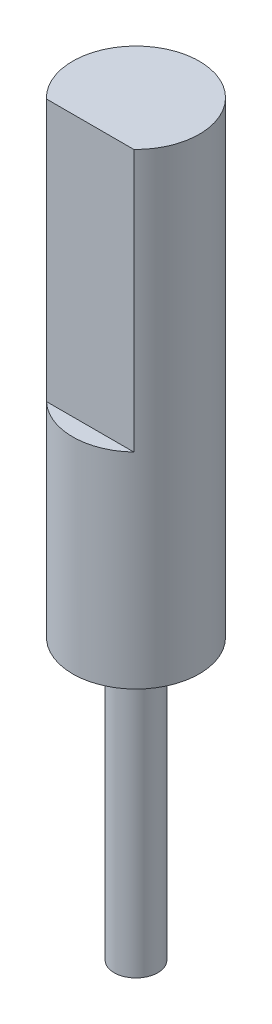
ISO-10303-21;
HEADER;
FILE_DESCRIPTION(('STEP AP214'),'2;1');
FILE_NAME('part.step','',(''),(''),'','','');
FILE_SCHEMA(('AUTOMOTIVE_DESIGN { 1 0 10303 214 1 1 1 1 }'));
ENDSEC;
DATA;
#1=APPLICATION_CONTEXT('core data for automotive mechanical design processes');
#2=APPLICATION_PROTOCOL_DEFINITION('international standard','automotive_design',2000,#1);
#3=PRODUCT_CONTEXT('',#1,'mechanical');
#4=PRODUCT('Part','Part','',(#3));
#5=PRODUCT_RELATED_PRODUCT_CATEGORY('part','',(#4));
#6=PRODUCT_DEFINITION_FORMATION('','',#4);
#7=PRODUCT_DEFINITION_CONTEXT('part definition',#1,'design');
#8=PRODUCT_DEFINITION('design','',#6,#7);
#9=PRODUCT_DEFINITION_SHAPE('','',#8);
#10=(LENGTH_UNIT() NAMED_UNIT(*) SI_UNIT(.MILLI.,.METRE.));
#11=(NAMED_UNIT(*) PLANE_ANGLE_UNIT() SI_UNIT($,.RADIAN.));
#12=(NAMED_UNIT(*) SI_UNIT($,.STERADIAN.) SOLID_ANGLE_UNIT());
#13=UNCERTAINTY_MEASURE_WITH_UNIT(LENGTH_MEASURE(1.E-05),#10,'distance_accuracy_value','');
#14=(GEOMETRIC_REPRESENTATION_CONTEXT(3) GLOBAL_UNCERTAINTY_ASSIGNED_CONTEXT((#13)) GLOBAL_UNIT_ASSIGNED_CONTEXT((#10,
#11,#12)) REPRESENTATION_CONTEXT('',''));
#15=CARTESIAN_POINT('',(0.,0.,0.));
#16=DIRECTION('',(0.,0.,1.));
#17=DIRECTION('',(1.,0.,0.));
#18=AXIS2_PLACEMENT_3D('',#15,#16,#17);
#19=CARTESIAN_POINT('',(0.,10.7,0.));
#20=DIRECTION('',(0.,-1.,0.));
#21=DIRECTION('',(0.,0.,-1.));
#22=AXIS2_PLACEMENT_3D('',#19,#20,#21);
#23=CYLINDRICAL_SURFACE('',#22,1.45);
#24=CARTESIAN_POINT('',(0.,10.7,0.));
#25=DIRECTION('',(0.,1.,0.));
#26=DIRECTION('',(0.,0.,1.));
#27=AXIS2_PLACEMENT_3D('',#24,#25,#26);
#28=CIRCLE('',#27,1.45);
#29=CARTESIAN_POINT('',(0.999999999999999,10.7,1.05));
#30=VERTEX_POINT('',#29);
#31=CARTESIAN_POINT('',(-0.999999999999999,10.7,1.05));
#32=VERTEX_POINT('',#31);
#33=EDGE_CURVE('E62',#30,#32,#28,.T.);
#34=ORIENTED_EDGE('',*,*,#33,.F.);
#35=DIRECTION('',(0.,1.,0.));
#36=VECTOR('',#35,1.);
#37=CARTESIAN_POINT('',(0.999999999999999,4.7,1.05));
#38=LINE('',#37,#36);
#39=CARTESIAN_POINT('',(0.999999999999999,4.7,1.05));
#40=VERTEX_POINT('',#39);
#41=EDGE_CURVE('E70',#40,#30,#38,.T.);
#42=ORIENTED_EDGE('',*,*,#41,.F.);
#43=CARTESIAN_POINT('',(0.,4.7,0.));
#44=DIRECTION('',(0.,1.,0.));
#45=DIRECTION('',(0.,0.,1.));
#46=AXIS2_PLACEMENT_3D('',#43,#44,#45);
#47=CIRCLE('',#46,1.45);
#48=CARTESIAN_POINT('',(-0.999999999999999,4.7,1.05));
#49=VERTEX_POINT('',#48);
#50=EDGE_CURVE('E86',#49,#40,#47,.T.);
#51=ORIENTED_EDGE('',*,*,#50,.F.);
#52=DIRECTION('',(0.,1.,0.));
#53=VECTOR('',#52,1.);
#54=CARTESIAN_POINT('',(-0.999999999999999,4.7,1.05));
#55=LINE('',#54,#53);
#56=EDGE_CURVE('E76',#49,#32,#55,.T.);
#57=ORIENTED_EDGE('',*,*,#56,.T.);
#58=EDGE_LOOP('',(#34,#42,#51,#57));
#59=FACE_BOUND('',#58,.T.);
#60=CARTESIAN_POINT('',(0.,0.,0.));
#61=DIRECTION('',(0.,1.,0.));
#62=DIRECTION('',(0.,0.,1.));
#63=AXIS2_PLACEMENT_3D('',#60,#61,#62);
#64=CIRCLE('',#63,1.45);
#65=CARTESIAN_POINT('',(0.,0.,1.45));
#66=VERTEX_POINT('',#65);
#67=EDGE_CURVE('E57',#66,#66,#64,.T.);
#68=ORIENTED_EDGE('',*,*,#67,.T.);
#69=EDGE_LOOP('',(#68));
#70=FACE_BOUND('',#69,.T.);
#71=ADVANCED_FACE('F54',(#59,#70),#23,.T.);
#72=CARTESIAN_POINT('',(0.,10.7,0.));
#73=DIRECTION('',(0.,1.,0.));
#74=DIRECTION('',(0.,0.,1.));
#75=AXIS2_PLACEMENT_3D('',#72,#73,#74);
#76=PLANE('',#75);
#77=DIRECTION('',(-1.,0.,0.));
#78=VECTOR('',#77,1.);
#79=CARTESIAN_POINT('',(-0.999999999999999,10.7,1.05));
#80=LINE('',#79,#78);
#81=EDGE_CURVE('E81',#30,#32,#80,.T.);
#82=ORIENTED_EDGE('',*,*,#81,.F.);
#83=ORIENTED_EDGE('',*,*,#33,.T.);
#84=EDGE_LOOP('',(#82,#83));
#85=FACE_BOUND('',#84,.T.);
#86=ADVANCED_FACE('F93',(#85),#76,.T.);
#87=CARTESIAN_POINT('',(0.,0.,0.));
#88=DIRECTION('',(0.,1.,0.));
#89=DIRECTION('',(0.,0.,1.));
#90=AXIS2_PLACEMENT_3D('',#87,#88,#89);
#91=PLANE('',#90);
#92=CARTESIAN_POINT('',(0.,0.,0.));
#93=DIRECTION('',(0.,-1.,0.));
#94=DIRECTION('',(0.,0.,-1.));
#95=AXIS2_PLACEMENT_3D('',#92,#93,#94);
#96=CIRCLE('',#95,0.5);
#97=CARTESIAN_POINT('',(0.,0.,-0.5));
#98=VERTEX_POINT('',#97);
#99=EDGE_CURVE('E13',#98,#98,#96,.T.);
#100=ORIENTED_EDGE('',*,*,#99,.F.);
#101=EDGE_LOOP('',(#100));
#102=FACE_BOUND('',#101,.T.);
#103=ORIENTED_EDGE('',*,*,#67,.F.);
#104=EDGE_LOOP('',(#103));
#105=FACE_BOUND('',#104,.T.);
#106=ADVANCED_FACE('F112',(#102,#105),#91,.F.);
#107=CARTESIAN_POINT('',(-0.999999999999999,4.7,1.05));
#108=DIRECTION('',(0.,0.,-1.));
#109=DIRECTION('',(-1.,0.,0.));
#110=AXIS2_PLACEMENT_3D('',#107,#108,#109);
#111=PLANE('',#110);
#112=ORIENTED_EDGE('',*,*,#81,.T.);
#113=ORIENTED_EDGE('',*,*,#56,.F.);
#114=DIRECTION('',(-1.,0.,0.));
#115=VECTOR('',#114,1.);
#116=CARTESIAN_POINT('',(-0.999999999999999,4.7,1.05));
#117=LINE('',#116,#115);
#118=EDGE_CURVE('E96',#40,#49,#117,.T.);
#119=ORIENTED_EDGE('',*,*,#118,.F.);
#120=ORIENTED_EDGE('',*,*,#41,.T.);
#121=EDGE_LOOP('',(#112,#113,#119,#120));
#122=FACE_BOUND('',#121,.T.);
#123=ADVANCED_FACE('F82',(#122),#111,.F.);
#124=CARTESIAN_POINT('',(0.,4.7,0.));
#125=DIRECTION('',(0.,1.,0.));
#126=DIRECTION('',(0.,0.,1.));
#127=AXIS2_PLACEMENT_3D('',#124,#125,#126);
#128=PLANE('',#127);
#129=ORIENTED_EDGE('',*,*,#50,.T.);
#130=ORIENTED_EDGE('',*,*,#118,.T.);
#131=EDGE_LOOP('',(#129,#130));
#132=FACE_BOUND('',#131,.T.);
#133=ADVANCED_FACE('F108',(#132),#128,.T.);
#134=CARTESIAN_POINT('',(0.,-6.4,0.));
#135=DIRECTION('',(0.,1.,0.));
#136=DIRECTION('',(0.,0.,1.));
#137=AXIS2_PLACEMENT_3D('',#134,#135,#136);
#138=CYLINDRICAL_SURFACE('',#137,0.5);
#139=CARTESIAN_POINT('',(0.,-6.4,0.));
#140=DIRECTION('',(0.,-1.,0.));
#141=DIRECTION('',(0.,0.,-1.));
#142=AXIS2_PLACEMENT_3D('',#139,#140,#141);
#143=CIRCLE('',#142,0.5);
#144=CARTESIAN_POINT('',(0.,-6.4,-0.5));
#145=VERTEX_POINT('',#144);
#146=EDGE_CURVE('E87',#145,#145,#143,.T.);
#147=ORIENTED_EDGE('',*,*,#146,.F.);
#148=EDGE_LOOP('',(#147));
#149=FACE_BOUND('',#148,.T.);
#150=ORIENTED_EDGE('',*,*,#99,.T.);
#151=EDGE_LOOP('',(#150));
#152=FACE_BOUND('',#151,.T.);
#153=ADVANCED_FACE('F105',(#149,#152),#138,.T.);
#154=CARTESIAN_POINT('',(0.,-6.4,0.));
#155=DIRECTION('',(0.,-1.,0.));
#156=DIRECTION('',(0.,0.,-1.));
#157=AXIS2_PLACEMENT_3D('',#154,#155,#156);
#158=PLANE('',#157);
#159=ORIENTED_EDGE('',*,*,#146,.T.);
#160=EDGE_LOOP('',(#159));
#161=FACE_BOUND('',#160,.T.);
#162=ADVANCED_FACE('F103',(#161),#158,.T.);
#163=CLOSED_SHELL('',(#71,#86,#106,#123,#133,#153,#162));
#164=MANIFOLD_SOLID_BREP('B2',#163);
#165=ADVANCED_BREP_SHAPE_REPRESENTATION('',(#18,#164),#14);
#166=SHAPE_DEFINITION_REPRESENTATION(#9,#165);
ENDSEC;
END-ISO-10303-21;
